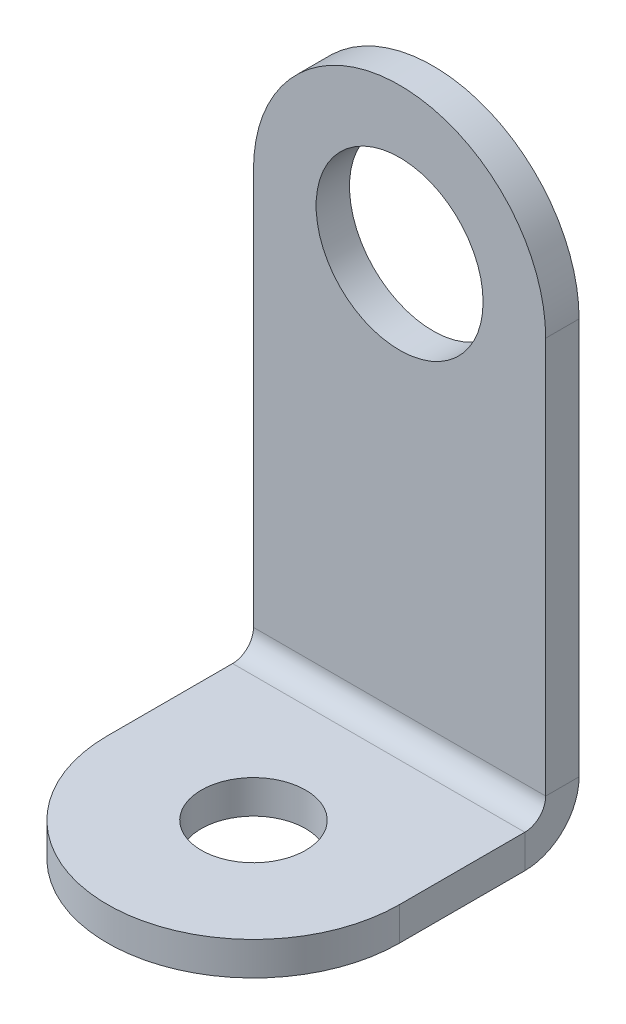
ISO-10303-21;
HEADER;
FILE_DESCRIPTION(('STEP AP214'),'2;1');
FILE_NAME('part.step','',(''),(''),'','','');
FILE_SCHEMA(('AUTOMOTIVE_DESIGN { 1 0 10303 214 1 1 1 1 }'));
ENDSEC;
DATA;
#1=APPLICATION_CONTEXT('core data for automotive mechanical design processes');
#2=APPLICATION_PROTOCOL_DEFINITION('international standard','automotive_design',2000,#1);
#3=PRODUCT_CONTEXT('',#1,'mechanical');
#4=PRODUCT('Part','Part','',(#3));
#5=PRODUCT_RELATED_PRODUCT_CATEGORY('part','',(#4));
#6=PRODUCT_DEFINITION_FORMATION('','',#4);
#7=PRODUCT_DEFINITION_CONTEXT('part definition',#1,'design');
#8=PRODUCT_DEFINITION('design','',#6,#7);
#9=PRODUCT_DEFINITION_SHAPE('','',#8);
#10=(LENGTH_UNIT() NAMED_UNIT(*) SI_UNIT(.MILLI.,.METRE.));
#11=(NAMED_UNIT(*) PLANE_ANGLE_UNIT() SI_UNIT($,.RADIAN.));
#12=(NAMED_UNIT(*) SI_UNIT($,.STERADIAN.) SOLID_ANGLE_UNIT());
#13=UNCERTAINTY_MEASURE_WITH_UNIT(LENGTH_MEASURE(1.E-05),#10,'distance_accuracy_value','');
#14=(GEOMETRIC_REPRESENTATION_CONTEXT(3) GLOBAL_UNCERTAINTY_ASSIGNED_CONTEXT((#13)) GLOBAL_UNIT_ASSIGNED_CONTEXT((#10,
#11,#12)) REPRESENTATION_CONTEXT('',''));
#15=CARTESIAN_POINT('',(0.,0.,0.));
#16=DIRECTION('',(0.,0.,1.));
#17=DIRECTION('',(1.,0.,0.));
#18=AXIS2_PLACEMENT_3D('',#15,#16,#17);
#19=CARTESIAN_POINT('',(7.,0.,-1.6002));
#20=DIRECTION('',(1.,0.,0.));
#21=DIRECTION('',(0.,1.,0.));
#22=AXIS2_PLACEMENT_3D('',#19,#20,#21);
#23=PLANE('',#22);
#24=DIRECTION('',(0.,1.,0.));
#25=VECTOR('',#24,1.);
#26=CARTESIAN_POINT('',(7.,0.,0.));
#27=LINE('',#26,#25);
#28=CARTESIAN_POINT('',(7.,-18.99999946,0.));
#29=VERTEX_POINT('',#28);
#30=CARTESIAN_POINT('',(7.,0.,0.));
#31=VERTEX_POINT('',#30);
#32=EDGE_CURVE('E89',#29,#31,#27,.T.);
#33=ORIENTED_EDGE('',*,*,#32,.F.);
#34=DIRECTION('',(0.,0.,-1.));
#35=VECTOR('',#34,1.);
#36=CARTESIAN_POINT('',(7.,-18.99999946,0.));
#37=LINE('',#36,#35);
#38=CARTESIAN_POINT('',(7.,-18.99999946,-1.60019999999999));
#39=VERTEX_POINT('',#38);
#40=EDGE_CURVE('E108',#29,#39,#37,.T.);
#41=ORIENTED_EDGE('',*,*,#40,.T.);
#42=DIRECTION('',(0.,1.,0.));
#43=VECTOR('',#42,1.);
#44=CARTESIAN_POINT('',(7.,0.,-1.6002));
#45=LINE('',#44,#43);
#46=CARTESIAN_POINT('',(7.,0.,-1.6002));
#47=VERTEX_POINT('',#46);
#48=EDGE_CURVE('E94',#39,#47,#45,.T.);
#49=ORIENTED_EDGE('',*,*,#48,.T.);
#50=DIRECTION('',(0.,0.,1.));
#51=VECTOR('',#50,1.);
#52=CARTESIAN_POINT('',(7.,0.,-1.6002));
#53=LINE('',#52,#51);
#54=EDGE_CURVE('E44',#47,#31,#53,.T.);
#55=ORIENTED_EDGE('',*,*,#54,.T.);
#56=EDGE_LOOP('',(#33,#41,#49,#55));
#57=FACE_BOUND('',#56,.T.);
#58=ADVANCED_FACE('F41',(#57),#23,.T.);
#59=CARTESIAN_POINT('',(0.,0.,-1.6002));
#60=DIRECTION('',(0.,0.,-1.));
#61=DIRECTION('',(-1.,0.,0.));
#62=AXIS2_PLACEMENT_3D('',#59,#60,#61);
#63=PLANE('',#62);
#64=CARTESIAN_POINT('',(0.,0.,-1.6002));
#65=DIRECTION('',(0.,0.,1.));
#66=DIRECTION('',(1.,0.,0.));
#67=AXIS2_PLACEMENT_3D('',#64,#65,#66);
#68=CIRCLE('',#67,4.);
#69=CARTESIAN_POINT('',(4.,0.,-1.6002));
#70=VERTEX_POINT('',#69);
#71=EDGE_CURVE('E99',#70,#70,#68,.T.);
#72=ORIENTED_EDGE('',*,*,#71,.T.);
#73=EDGE_LOOP('',(#72));
#74=FACE_BOUND('',#73,.T.);
#75=ORIENTED_EDGE('',*,*,#48,.F.);
#76=DIRECTION('',(1.,0.,0.));
#77=VECTOR('',#76,1.);
#78=CARTESIAN_POINT('',(7.,-18.99999946,-1.60019999999999));
#79=LINE('',#78,#77);
#80=CARTESIAN_POINT('',(-7.,-18.99999946,-1.6002));
#81=VERTEX_POINT('',#80);
#82=EDGE_CURVE('E125',#39,#81,#79,.F.);
#83=ORIENTED_EDGE('',*,*,#82,.T.);
#84=DIRECTION('',(0.,-1.,0.));
#85=VECTOR('',#84,1.);
#86=CARTESIAN_POINT('',(-7.,-20.,-1.6002));
#87=LINE('',#86,#85);
#88=CARTESIAN_POINT('',(-7.,0.,-1.6002));
#89=VERTEX_POINT('',#88);
#90=EDGE_CURVE('E100',#89,#81,#87,.T.);
#91=ORIENTED_EDGE('',*,*,#90,.F.);
#92=CARTESIAN_POINT('',(0.,0.,-1.6002));
#93=DIRECTION('',(0.,0.,1.));
#94=DIRECTION('',(-1.,0.,0.));
#95=AXIS2_PLACEMENT_3D('',#92,#93,#94);
#96=CIRCLE('',#95,7.);
#97=EDGE_CURVE('E79',#47,#89,#96,.T.);
#98=ORIENTED_EDGE('',*,*,#97,.F.);
#99=EDGE_LOOP('',(#75,#83,#91,#98));
#100=FACE_BOUND('',#99,.T.);
#101=ADVANCED_FACE('F219',(#74,#100),#63,.T.);
#102=CARTESIAN_POINT('',(0.,0.,0.));
#103=DIRECTION('',(0.,0.,-1.));
#104=DIRECTION('',(-1.,0.,0.));
#105=AXIS2_PLACEMENT_3D('',#102,#103,#104);
#106=PLANE('',#105);
#107=CARTESIAN_POINT('',(0.,0.,0.));
#108=DIRECTION('',(0.,0.,1.));
#109=DIRECTION('',(1.,0.,0.));
#110=AXIS2_PLACEMENT_3D('',#107,#108,#109);
#111=CIRCLE('',#110,4.);
#112=CARTESIAN_POINT('',(4.,0.,0.));
#113=VERTEX_POINT('',#112);
#114=EDGE_CURVE('E103',#113,#113,#111,.T.);
#115=ORIENTED_EDGE('',*,*,#114,.F.);
#116=EDGE_LOOP('',(#115));
#117=FACE_BOUND('',#116,.T.);
#118=DIRECTION('',(1.,0.,0.));
#119=VECTOR('',#118,1.);
#120=CARTESIAN_POINT('',(7.,-18.99999946,0.));
#121=LINE('',#120,#119);
#122=CARTESIAN_POINT('',(-7.,-18.99999946,0.));
#123=VERTEX_POINT('',#122);
#124=EDGE_CURVE('E115',#29,#123,#121,.F.);
#125=ORIENTED_EDGE('',*,*,#124,.F.);
#126=ORIENTED_EDGE('',*,*,#32,.T.);
#127=CARTESIAN_POINT('',(0.,0.,0.));
#128=DIRECTION('',(0.,0.,1.));
#129=DIRECTION('',(-1.,0.,0.));
#130=AXIS2_PLACEMENT_3D('',#127,#128,#129);
#131=CIRCLE('',#130,7.);
#132=CARTESIAN_POINT('',(-7.,0.,0.));
#133=VERTEX_POINT('',#132);
#134=EDGE_CURVE('E77',#31,#133,#131,.T.);
#135=ORIENTED_EDGE('',*,*,#134,.T.);
#136=DIRECTION('',(0.,-1.,0.));
#137=VECTOR('',#136,1.);
#138=CARTESIAN_POINT('',(-7.,-20.,0.));
#139=LINE('',#138,#137);
#140=EDGE_CURVE('E86',#133,#123,#139,.T.);
#141=ORIENTED_EDGE('',*,*,#140,.T.);
#142=EDGE_LOOP('',(#125,#126,#135,#141));
#143=FACE_BOUND('',#142,.T.);
#144=ADVANCED_FACE('F84',(#117,#143),#106,.F.);
#145=CARTESIAN_POINT('',(-7.,-20.,-1.6002));
#146=DIRECTION('',(-1.,0.,0.));
#147=DIRECTION('',(0.,0.,1.));
#148=AXIS2_PLACEMENT_3D('',#145,#146,#147);
#149=PLANE('',#148);
#150=DIRECTION('',(0.,0.,-1.));
#151=VECTOR('',#150,1.);
#152=CARTESIAN_POINT('',(-7.,-18.99999946,0.));
#153=LINE('',#152,#151);
#154=EDGE_CURVE('E93',#123,#81,#153,.T.);
#155=ORIENTED_EDGE('',*,*,#154,.F.);
#156=ORIENTED_EDGE('',*,*,#140,.F.);
#157=DIRECTION('',(0.,0.,1.));
#158=VECTOR('',#157,1.);
#159=CARTESIAN_POINT('',(-7.,0.,-1.6002));
#160=LINE('',#159,#158);
#161=EDGE_CURVE('E11',#89,#133,#160,.T.);
#162=ORIENTED_EDGE('',*,*,#161,.F.);
#163=ORIENTED_EDGE('',*,*,#90,.T.);
#164=EDGE_LOOP('',(#155,#156,#162,#163));
#165=FACE_BOUND('',#164,.T.);
#166=ADVANCED_FACE('F92',(#165),#149,.T.);
#167=CARTESIAN_POINT('',(0.,0.,-1.6002));
#168=DIRECTION('',(0.,0.,1.));
#169=DIRECTION('',(1.,0.,0.));
#170=AXIS2_PLACEMENT_3D('',#167,#168,#169);
#171=CYLINDRICAL_SURFACE('',#170,7.);
#172=ORIENTED_EDGE('',*,*,#134,.F.);
#173=ORIENTED_EDGE('',*,*,#54,.F.);
#174=ORIENTED_EDGE('',*,*,#97,.T.);
#175=ORIENTED_EDGE('',*,*,#161,.T.);
#176=EDGE_LOOP('',(#172,#173,#174,#175));
#177=FACE_BOUND('',#176,.T.);
#178=ADVANCED_FACE('F75',(#177),#171,.T.);
#179=CARTESIAN_POINT('',(0.,0.,-1.6002));
#180=DIRECTION('',(0.,0.,1.));
#181=DIRECTION('',(1.,0.,0.));
#182=AXIS2_PLACEMENT_3D('',#179,#180,#181);
#183=CYLINDRICAL_SURFACE('',#182,4.);
#184=ORIENTED_EDGE('',*,*,#71,.F.);
#185=EDGE_LOOP('',(#184));
#186=FACE_BOUND('',#185,.T.);
#187=ORIENTED_EDGE('',*,*,#114,.T.);
#188=EDGE_LOOP('',(#187));
#189=FACE_BOUND('',#188,.T.);
#190=ADVANCED_FACE('F235',(#186,#189),#183,.F.);
#191=CARTESIAN_POINT('',(-7.,-18.99999946,1.00000054));
#192=DIRECTION('',(-1.,0.,0.));
#193=DIRECTION('',(0.,0.,1.));
#194=AXIS2_PLACEMENT_3D('',#191,#192,#193);
#195=PLANE('',#194);
#196=DIRECTION('',(0.,-1.,0.));
#197=VECTOR('',#196,1.);
#198=CARTESIAN_POINT('',(-7.,-20.,1.00000054));
#199=LINE('',#198,#197);
#200=CARTESIAN_POINT('',(-7.,-20.,1.00000054));
#201=VERTEX_POINT('',#200);
#202=CARTESIAN_POINT('',(-7.,-21.6002,1.00000053999999));
#203=VERTEX_POINT('',#202);
#204=EDGE_CURVE('E161',#201,#203,#199,.T.);
#205=ORIENTED_EDGE('',*,*,#204,.F.);
#206=CARTESIAN_POINT('',(-7.,-18.99999946,1.00000054));
#207=DIRECTION('',(1.,0.,0.));
#208=DIRECTION('',(0.,0.,-1.));
#209=AXIS2_PLACEMENT_3D('',#206,#207,#208);
#210=CIRCLE('',#209,1.00000054);
#211=EDGE_CURVE('E119',#123,#201,#210,.F.);
#212=ORIENTED_EDGE('',*,*,#211,.F.);
#213=ORIENTED_EDGE('',*,*,#154,.T.);
#214=CARTESIAN_POINT('',(-7.,-18.99999946,1.00000054));
#215=DIRECTION('',(1.,0.,0.));
#216=DIRECTION('',(0.,0.,-1.));
#217=AXIS2_PLACEMENT_3D('',#214,#215,#216);
#218=CIRCLE('',#217,2.60020054);
#219=EDGE_CURVE('E55',#81,#203,#218,.F.);
#220=ORIENTED_EDGE('',*,*,#219,.T.);
#221=EDGE_LOOP('',(#205,#212,#213,#220));
#222=FACE_BOUND('',#221,.T.);
#223=ADVANCED_FACE('F216',(#222),#195,.T.);
#224=CARTESIAN_POINT('',(7.,-18.99999946,1.00000054));
#225=DIRECTION('',(-1.,0.,0.));
#226=DIRECTION('',(0.,0.,1.));
#227=AXIS2_PLACEMENT_3D('',#224,#225,#226);
#228=PLANE('',#227);
#229=CARTESIAN_POINT('',(7.,-18.99999946,1.00000054));
#230=DIRECTION('',(1.,0.,0.));
#231=DIRECTION('',(0.,0.,-1.));
#232=AXIS2_PLACEMENT_3D('',#229,#230,#231);
#233=CIRCLE('',#232,1.00000054);
#234=CARTESIAN_POINT('',(7.,-20.,1.00000054));
#235=VERTEX_POINT('',#234);
#236=EDGE_CURVE('E112',#235,#29,#233,.T.);
#237=ORIENTED_EDGE('',*,*,#236,.F.);
#238=DIRECTION('',(0.,-1.,0.));
#239=VECTOR('',#238,1.);
#240=CARTESIAN_POINT('',(7.,-20.,1.00000054));
#241=LINE('',#240,#239);
#242=CARTESIAN_POINT('',(7.,-21.6002,1.00000053999999));
#243=VERTEX_POINT('',#242);
#244=EDGE_CURVE('E160',#235,#243,#241,.T.);
#245=ORIENTED_EDGE('',*,*,#244,.T.);
#246=CARTESIAN_POINT('',(7.,-18.99999946,1.00000054));
#247=DIRECTION('',(1.,0.,0.));
#248=DIRECTION('',(0.,0.,-1.));
#249=AXIS2_PLACEMENT_3D('',#246,#247,#248);
#250=CIRCLE('',#249,2.60020054);
#251=EDGE_CURVE('E122',#243,#39,#250,.T.);
#252=ORIENTED_EDGE('',*,*,#251,.T.);
#253=ORIENTED_EDGE('',*,*,#40,.F.);
#254=EDGE_LOOP('',(#237,#245,#252,#253));
#255=FACE_BOUND('',#254,.T.);
#256=ADVANCED_FACE('F182',(#255),#228,.F.);
#257=CARTESIAN_POINT('',(7.,-18.99999946,1.00000054));
#258=DIRECTION('',(1.,0.,0.));
#259=DIRECTION('',(0.,-1.,0.));
#260=AXIS2_PLACEMENT_3D('',#257,#258,#259);
#261=CYLINDRICAL_SURFACE('',#260,2.60020054);
#262=ORIENTED_EDGE('',*,*,#82,.F.);
#263=ORIENTED_EDGE('',*,*,#251,.F.);
#264=DIRECTION('',(-1.,0.,0.));
#265=VECTOR('',#264,1.);
#266=CARTESIAN_POINT('',(0.,-21.6002,1.00000053999999));
#267=LINE('',#266,#265);
#268=EDGE_CURVE('E156',#243,#203,#267,.T.);
#269=ORIENTED_EDGE('',*,*,#268,.T.);
#270=ORIENTED_EDGE('',*,*,#219,.F.);
#271=EDGE_LOOP('',(#262,#263,#269,#270));
#272=FACE_BOUND('',#271,.T.);
#273=ADVANCED_FACE('F220',(#272),#261,.T.);
#274=CARTESIAN_POINT('',(7.,-18.99999946,1.00000054));
#275=DIRECTION('',(1.,0.,0.));
#276=DIRECTION('',(0.,-1.,0.));
#277=AXIS2_PLACEMENT_3D('',#274,#275,#276);
#278=CYLINDRICAL_SURFACE('',#277,1.00000054);
#279=ORIENTED_EDGE('',*,*,#124,.T.);
#280=ORIENTED_EDGE('',*,*,#211,.T.);
#281=DIRECTION('',(1.,0.,0.));
#282=VECTOR('',#281,1.);
#283=CARTESIAN_POINT('',(-7.,-20.,1.00000054));
#284=LINE('',#283,#282);
#285=EDGE_CURVE('E164',#201,#235,#284,.T.);
#286=ORIENTED_EDGE('',*,*,#285,.T.);
#287=ORIENTED_EDGE('',*,*,#236,.T.);
#288=EDGE_LOOP('',(#279,#280,#286,#287));
#289=FACE_BOUND('',#288,.T.);
#290=ADVANCED_FACE('F172',(#289),#278,.F.);
#291=CARTESIAN_POINT('',(0.,-21.6002,6.99999999999999));
#292=DIRECTION('',(0.,1.,0.));
#293=DIRECTION('',(0.,0.,1.));
#294=AXIS2_PLACEMENT_3D('',#291,#292,#293);
#295=PLANE('',#294);
#296=CARTESIAN_POINT('',(0.,-21.6002,6.99999999999999));
#297=DIRECTION('',(0.,-1.,0.));
#298=DIRECTION('',(0.,0.,-1.));
#299=AXIS2_PLACEMENT_3D('',#296,#297,#298);
#300=CIRCLE('',#299,2.5);
#301=CARTESIAN_POINT('',(0.,-21.6002,4.49999999999999));
#302=VERTEX_POINT('',#301);
#303=EDGE_CURVE('E145',#302,#302,#300,.T.);
#304=ORIENTED_EDGE('',*,*,#303,.F.);
#305=EDGE_LOOP('',(#304));
#306=FACE_BOUND('',#305,.T.);
#307=ORIENTED_EDGE('',*,*,#268,.F.);
#308=DIRECTION('',(0.,0.,1.));
#309=VECTOR('',#308,1.);
#310=CARTESIAN_POINT('',(6.99999999999999,-21.6002,7.));
#311=LINE('',#310,#309);
#312=CARTESIAN_POINT('',(6.99999999999999,-21.6002,7.));
#313=VERTEX_POINT('',#312);
#314=EDGE_CURVE('E148',#243,#313,#311,.T.);
#315=ORIENTED_EDGE('',*,*,#314,.T.);
#316=CARTESIAN_POINT('',(0.,-21.6002,6.99999999999999));
#317=DIRECTION('',(0.,-1.,0.));
#318=DIRECTION('',(0.,0.,1.));
#319=AXIS2_PLACEMENT_3D('',#316,#317,#318);
#320=CIRCLE('',#319,7.);
#321=CARTESIAN_POINT('',(-7.00000000000001,-21.6002,6.99999999999999));
#322=VERTEX_POINT('',#321);
#323=EDGE_CURVE('E134',#313,#322,#320,.T.);
#324=ORIENTED_EDGE('',*,*,#323,.T.);
#325=DIRECTION('',(0.,0.,-1.));
#326=VECTOR('',#325,1.);
#327=CARTESIAN_POINT('',(-7.,-21.6002,0.));
#328=LINE('',#327,#326);
#329=EDGE_CURVE('E138',#322,#203,#328,.T.);
#330=ORIENTED_EDGE('',*,*,#329,.T.);
#331=EDGE_LOOP('',(#307,#315,#324,#330));
#332=FACE_BOUND('',#331,.T.);
#333=ADVANCED_FACE('F208',(#306,#332),#295,.F.);
#334=CARTESIAN_POINT('',(0.,-20.,7.));
#335=DIRECTION('',(0.,1.,0.));
#336=DIRECTION('',(0.,0.,1.));
#337=AXIS2_PLACEMENT_3D('',#334,#335,#336);
#338=PLANE('',#337);
#339=CARTESIAN_POINT('',(0.,-20.,7.));
#340=DIRECTION('',(0.,-1.,0.));
#341=DIRECTION('',(0.,0.,-1.));
#342=AXIS2_PLACEMENT_3D('',#339,#340,#341);
#343=CIRCLE('',#342,2.5);
#344=CARTESIAN_POINT('',(0.,-20.,4.5));
#345=VERTEX_POINT('',#344);
#346=EDGE_CURVE('E153',#345,#345,#343,.T.);
#347=ORIENTED_EDGE('',*,*,#346,.T.);
#348=EDGE_LOOP('',(#347));
#349=FACE_BOUND('',#348,.T.);
#350=DIRECTION('',(0.,0.,1.));
#351=VECTOR('',#350,1.);
#352=CARTESIAN_POINT('',(6.99999999999999,-20.,7.));
#353=LINE('',#352,#351);
#354=CARTESIAN_POINT('',(6.99999999999999,-20.,7.));
#355=VERTEX_POINT('',#354);
#356=EDGE_CURVE('E139',#235,#355,#353,.T.);
#357=ORIENTED_EDGE('',*,*,#356,.F.);
#358=ORIENTED_EDGE('',*,*,#285,.F.);
#359=DIRECTION('',(0.,0.,-1.));
#360=VECTOR('',#359,1.);
#361=CARTESIAN_POINT('',(-7.,-20.,0.));
#362=LINE('',#361,#360);
#363=CARTESIAN_POINT('',(-7.00000000000001,-20.,7.));
#364=VERTEX_POINT('',#363);
#365=EDGE_CURVE('E142',#364,#201,#362,.T.);
#366=ORIENTED_EDGE('',*,*,#365,.F.);
#367=CARTESIAN_POINT('',(0.,-20.,7.));
#368=DIRECTION('',(0.,-1.,0.));
#369=DIRECTION('',(0.,0.,1.));
#370=AXIS2_PLACEMENT_3D('',#367,#368,#369);
#371=CIRCLE('',#370,7.);
#372=EDGE_CURVE('E135',#355,#364,#371,.T.);
#373=ORIENTED_EDGE('',*,*,#372,.F.);
#374=EDGE_LOOP('',(#357,#358,#366,#373));
#375=FACE_BOUND('',#374,.T.);
#376=ADVANCED_FACE('F191',(#349,#375),#338,.T.);
#377=CARTESIAN_POINT('',(-7.,-21.6002,0.));
#378=DIRECTION('',(1.,0.,0.));
#379=DIRECTION('',(0.,0.,-1.));
#380=AXIS2_PLACEMENT_3D('',#377,#378,#379);
#381=PLANE('',#380);
#382=ORIENTED_EDGE('',*,*,#204,.T.);
#383=ORIENTED_EDGE('',*,*,#329,.F.);
#384=DIRECTION('',(0.,1.,0.));
#385=VECTOR('',#384,1.);
#386=CARTESIAN_POINT('',(-7.00000000000001,-21.6002,6.99999999999999));
#387=LINE('',#386,#385);
#388=EDGE_CURVE('E131',#322,#364,#387,.T.);
#389=ORIENTED_EDGE('',*,*,#388,.T.);
#390=ORIENTED_EDGE('',*,*,#365,.T.);
#391=EDGE_LOOP('',(#382,#383,#389,#390));
#392=FACE_BOUND('',#391,.T.);
#393=ADVANCED_FACE('F203',(#392),#381,.F.);
#394=CARTESIAN_POINT('',(6.99999999999999,-21.6002,7.));
#395=DIRECTION('',(-1.,0.,0.));
#396=DIRECTION('',(0.,0.,1.));
#397=AXIS2_PLACEMENT_3D('',#394,#395,#396);
#398=PLANE('',#397);
#399=ORIENTED_EDGE('',*,*,#244,.F.);
#400=ORIENTED_EDGE('',*,*,#356,.T.);
#401=DIRECTION('',(0.,1.,0.));
#402=VECTOR('',#401,1.);
#403=CARTESIAN_POINT('',(6.99999999999999,-21.6002,7.));
#404=LINE('',#403,#402);
#405=EDGE_CURVE('E116',#313,#355,#404,.T.);
#406=ORIENTED_EDGE('',*,*,#405,.F.);
#407=ORIENTED_EDGE('',*,*,#314,.F.);
#408=EDGE_LOOP('',(#399,#400,#406,#407));
#409=FACE_BOUND('',#408,.T.);
#410=ADVANCED_FACE('F186',(#409),#398,.F.);
#411=CARTESIAN_POINT('',(0.,-21.6002,6.99999999999999));
#412=DIRECTION('',(0.,1.,0.));
#413=DIRECTION('',(0.,0.,1.));
#414=AXIS2_PLACEMENT_3D('',#411,#412,#413);
#415=CYLINDRICAL_SURFACE('',#414,7.);
#416=ORIENTED_EDGE('',*,*,#372,.T.);
#417=ORIENTED_EDGE('',*,*,#388,.F.);
#418=ORIENTED_EDGE('',*,*,#323,.F.);
#419=ORIENTED_EDGE('',*,*,#405,.T.);
#420=EDGE_LOOP('',(#416,#417,#418,#419));
#421=FACE_BOUND('',#420,.T.);
#422=ADVANCED_FACE('F196',(#421),#415,.T.);
#423=CARTESIAN_POINT('',(0.,-21.6002,6.99999999999999));
#424=DIRECTION('',(0.,1.,0.));
#425=DIRECTION('',(0.,0.,1.));
#426=AXIS2_PLACEMENT_3D('',#423,#424,#425);
#427=CYLINDRICAL_SURFACE('',#426,2.5);
#428=ORIENTED_EDGE('',*,*,#303,.T.);
#429=EDGE_LOOP('',(#428));
#430=FACE_BOUND('',#429,.T.);
#431=ORIENTED_EDGE('',*,*,#346,.F.);
#432=EDGE_LOOP('',(#431));
#433=FACE_BOUND('',#432,.T.);
#434=ADVANCED_FACE('F264',(#430,#433),#427,.F.);
#435=CLOSED_SHELL('',(#58,#101,#144,#166,#178,#190,#223,#256,#273,#290,#333,#376,#393,#410,#422,#434));
#436=MANIFOLD_SOLID_BREP('B2',#435);
#437=ADVANCED_BREP_SHAPE_REPRESENTATION('',(#18,#436),#14);
#438=SHAPE_DEFINITION_REPRESENTATION(#9,#437);
ENDSEC;
END-ISO-10303-21;
